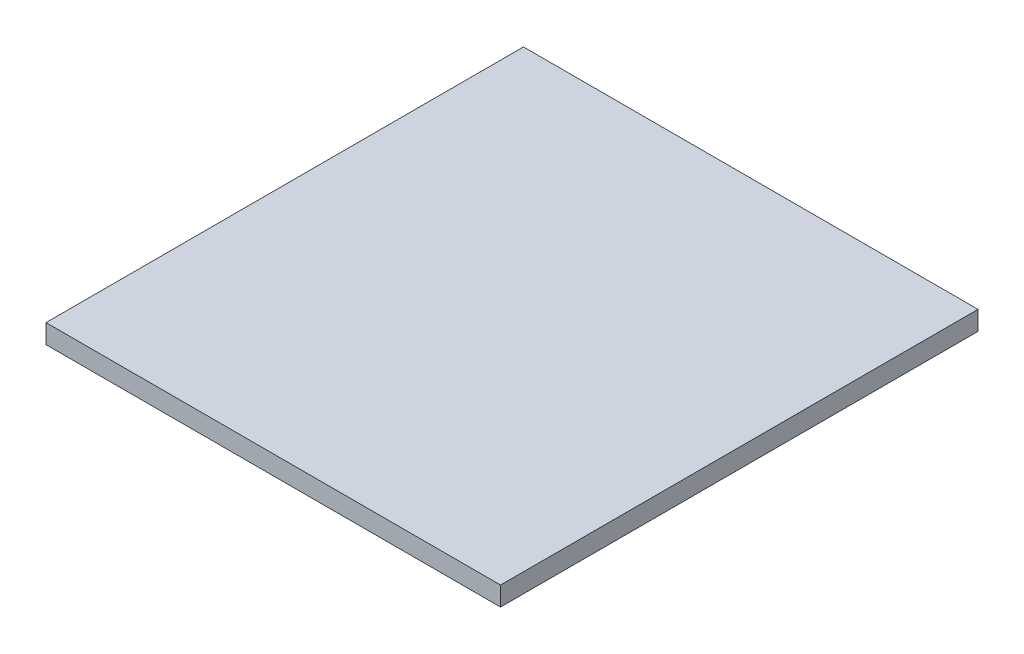
ISO-10303-21;
HEADER;
FILE_DESCRIPTION(('STEP AP214'),'2;1');
FILE_NAME('part.step','',(''),(''),'','','');
FILE_SCHEMA(('AUTOMOTIVE_DESIGN { 1 0 10303 214 1 1 1 1 }'));
ENDSEC;
DATA;
#1=APPLICATION_CONTEXT('core data for automotive mechanical design processes');
#2=APPLICATION_PROTOCOL_DEFINITION('international standard','automotive_design',2000,#1);
#3=PRODUCT_CONTEXT('',#1,'mechanical');
#4=PRODUCT('Part','Part','',(#3));
#5=PRODUCT_RELATED_PRODUCT_CATEGORY('part','',(#4));
#6=PRODUCT_DEFINITION_FORMATION('','',#4);
#7=PRODUCT_DEFINITION_CONTEXT('part definition',#1,'design');
#8=PRODUCT_DEFINITION('design','',#6,#7);
#9=PRODUCT_DEFINITION_SHAPE('','',#8);
#10=(LENGTH_UNIT() NAMED_UNIT(*) SI_UNIT(.MILLI.,.METRE.));
#11=(NAMED_UNIT(*) PLANE_ANGLE_UNIT() SI_UNIT($,.RADIAN.));
#12=(NAMED_UNIT(*) SI_UNIT($,.STERADIAN.) SOLID_ANGLE_UNIT());
#13=UNCERTAINTY_MEASURE_WITH_UNIT(LENGTH_MEASURE(1.E-05),#10,'distance_accuracy_value','');
#14=(GEOMETRIC_REPRESENTATION_CONTEXT(3) GLOBAL_UNCERTAINTY_ASSIGNED_CONTEXT((#13)) GLOBAL_UNIT_ASSIGNED_CONTEXT((#10,
#11,#12)) REPRESENTATION_CONTEXT('',''));
#15=CARTESIAN_POINT('',(0.,0.,0.));
#16=DIRECTION('',(0.,0.,1.));
#17=DIRECTION('',(1.,0.,0.));
#18=AXIS2_PLACEMENT_3D('',#15,#16,#17);
#19=CARTESIAN_POINT('',(0.,10.,0.));
#20=DIRECTION('',(1.,0.,0.));
#21=DIRECTION('',(0.,0.,-1.));
#22=AXIS2_PLACEMENT_3D('',#19,#20,#21);
#23=PLANE('',#22);
#24=DIRECTION('',(0.,0.,1.));
#25=VECTOR('',#24,1.);
#26=CARTESIAN_POINT('',(0.,0.,0.));
#27=LINE('',#26,#25);
#28=CARTESIAN_POINT('',(0.,0.,-250.));
#29=VERTEX_POINT('',#28);
#30=CARTESIAN_POINT('',(0.,0.,0.));
#31=VERTEX_POINT('',#30);
#32=EDGE_CURVE('E107',#29,#31,#27,.T.);
#33=ORIENTED_EDGE('',*,*,#32,.T.);
#34=DIRECTION('',(0.,-1.,0.));
#35=VECTOR('',#34,1.);
#36=CARTESIAN_POINT('',(0.,10.,0.));
#37=LINE('',#36,#35);
#38=CARTESIAN_POINT('',(0.,10.,0.));
#39=VERTEX_POINT('',#38);
#40=EDGE_CURVE('E11',#39,#31,#37,.T.);
#41=ORIENTED_EDGE('',*,*,#40,.F.);
#42=DIRECTION('',(0.,0.,1.));
#43=VECTOR('',#42,1.);
#44=CARTESIAN_POINT('',(0.,10.,0.));
#45=LINE('',#44,#43);
#46=CARTESIAN_POINT('',(0.,10.,-250.));
#47=VERTEX_POINT('',#46);
#48=EDGE_CURVE('E91',#47,#39,#45,.T.);
#49=ORIENTED_EDGE('',*,*,#48,.F.);
#50=DIRECTION('',(0.,-1.,0.));
#51=VECTOR('',#50,1.);
#52=CARTESIAN_POINT('',(0.,10.,-250.));
#53=LINE('',#52,#51);
#54=EDGE_CURVE('E103',#47,#29,#53,.T.);
#55=ORIENTED_EDGE('',*,*,#54,.T.);
#56=EDGE_LOOP('',(#33,#41,#49,#55));
#57=FACE_BOUND('',#56,.T.);
#58=ADVANCED_FACE('F39',(#57),#23,.F.);
#59=CARTESIAN_POINT('',(0.,10.,0.));
#60=DIRECTION('',(0.,0.,-1.));
#61=DIRECTION('',(-1.,0.,0.));
#62=AXIS2_PLACEMENT_3D('',#59,#60,#61);
#63=PLANE('',#62);
#64=DIRECTION('',(1.,0.,0.));
#65=VECTOR('',#64,1.);
#66=CARTESIAN_POINT('',(0.,0.,0.));
#67=LINE('',#66,#65);
#68=CARTESIAN_POINT('',(238.,0.,0.));
#69=VERTEX_POINT('',#68);
#70=EDGE_CURVE('E96',#31,#69,#67,.T.);
#71=ORIENTED_EDGE('',*,*,#70,.T.);
#72=DIRECTION('',(0.,-1.,0.));
#73=VECTOR('',#72,1.);
#74=CARTESIAN_POINT('',(238.,10.,0.));
#75=LINE('',#74,#73);
#76=CARTESIAN_POINT('',(238.,10.,0.));
#77=VERTEX_POINT('',#76);
#78=EDGE_CURVE('E48',#77,#69,#75,.T.);
#79=ORIENTED_EDGE('',*,*,#78,.F.);
#80=DIRECTION('',(1.,0.,0.));
#81=VECTOR('',#80,1.);
#82=CARTESIAN_POINT('',(0.,10.,0.));
#83=LINE('',#82,#81);
#84=EDGE_CURVE('E86',#39,#77,#83,.T.);
#85=ORIENTED_EDGE('',*,*,#84,.F.);
#86=ORIENTED_EDGE('',*,*,#40,.T.);
#87=EDGE_LOOP('',(#71,#79,#85,#86));
#88=FACE_BOUND('',#87,.T.);
#89=ADVANCED_FACE('F95',(#88),#63,.F.);
#90=CARTESIAN_POINT('',(238.,10.,0.));
#91=DIRECTION('',(-1.,0.,0.));
#92=DIRECTION('',(0.,0.,1.));
#93=AXIS2_PLACEMENT_3D('',#90,#91,#92);
#94=PLANE('',#93);
#95=DIRECTION('',(0.,0.,-1.));
#96=VECTOR('',#95,1.);
#97=CARTESIAN_POINT('',(238.,0.,0.));
#98=LINE('',#97,#96);
#99=CARTESIAN_POINT('',(238.,0.,-250.));
#100=VERTEX_POINT('',#99);
#101=EDGE_CURVE('E73',#69,#100,#98,.T.);
#102=ORIENTED_EDGE('',*,*,#101,.T.);
#103=DIRECTION('',(0.,-1.,0.));
#104=VECTOR('',#103,1.);
#105=CARTESIAN_POINT('',(238.,10.,-250.));
#106=LINE('',#105,#104);
#107=CARTESIAN_POINT('',(238.,10.,-250.));
#108=VERTEX_POINT('',#107);
#109=EDGE_CURVE('E98',#108,#100,#106,.T.);
#110=ORIENTED_EDGE('',*,*,#109,.F.);
#111=DIRECTION('',(0.,0.,-1.));
#112=VECTOR('',#111,1.);
#113=CARTESIAN_POINT('',(238.,10.,0.));
#114=LINE('',#113,#112);
#115=EDGE_CURVE('E89',#77,#108,#114,.T.);
#116=ORIENTED_EDGE('',*,*,#115,.F.);
#117=ORIENTED_EDGE('',*,*,#78,.T.);
#118=EDGE_LOOP('',(#102,#110,#116,#117));
#119=FACE_BOUND('',#118,.T.);
#120=ADVANCED_FACE('F99',(#119),#94,.F.);
#121=CARTESIAN_POINT('',(0.,10.,-250.));
#122=DIRECTION('',(0.,0.,1.));
#123=DIRECTION('',(1.,0.,0.));
#124=AXIS2_PLACEMENT_3D('',#121,#122,#123);
#125=PLANE('',#124);
#126=DIRECTION('',(-1.,0.,0.));
#127=VECTOR('',#126,1.);
#128=CARTESIAN_POINT('',(0.,0.,-250.));
#129=LINE('',#128,#127);
#130=EDGE_CURVE('E79',#100,#29,#129,.T.);
#131=ORIENTED_EDGE('',*,*,#130,.T.);
#132=ORIENTED_EDGE('',*,*,#54,.F.);
#133=DIRECTION('',(-1.,0.,0.));
#134=VECTOR('',#133,1.);
#135=CARTESIAN_POINT('',(0.,10.,-250.));
#136=LINE('',#135,#134);
#137=EDGE_CURVE('E56',#108,#47,#136,.T.);
#138=ORIENTED_EDGE('',*,*,#137,.F.);
#139=ORIENTED_EDGE('',*,*,#109,.T.);
#140=EDGE_LOOP('',(#131,#132,#138,#139));
#141=FACE_BOUND('',#140,.T.);
#142=ADVANCED_FACE('F120',(#141),#125,.F.);
#143=CARTESIAN_POINT('',(0.,10.,0.));
#144=DIRECTION('',(0.,-1.,0.));
#145=DIRECTION('',(0.,0.,-1.));
#146=AXIS2_PLACEMENT_3D('',#143,#144,#145);
#147=PLANE('',#146);
#148=ORIENTED_EDGE('',*,*,#48,.T.);
#149=ORIENTED_EDGE('',*,*,#84,.T.);
#150=ORIENTED_EDGE('',*,*,#115,.T.);
#151=ORIENTED_EDGE('',*,*,#137,.T.);
#152=EDGE_LOOP('',(#148,#149,#150,#151));
#153=FACE_BOUND('',#152,.T.);
#154=ADVANCED_FACE('F87',(#153),#147,.F.);
#155=CARTESIAN_POINT('',(0.,0.,0.));
#156=DIRECTION('',(0.,-1.,0.));
#157=DIRECTION('',(0.,0.,-1.));
#158=AXIS2_PLACEMENT_3D('',#155,#156,#157);
#159=PLANE('',#158);
#160=ORIENTED_EDGE('',*,*,#32,.F.);
#161=ORIENTED_EDGE('',*,*,#130,.F.);
#162=ORIENTED_EDGE('',*,*,#101,.F.);
#163=ORIENTED_EDGE('',*,*,#70,.F.);
#164=EDGE_LOOP('',(#160,#161,#162,#163));
#165=FACE_BOUND('',#164,.T.);
#166=ADVANCED_FACE('F123',(#165),#159,.T.);
#167=CLOSED_SHELL('',(#58,#89,#120,#142,#154,#166));
#168=MANIFOLD_SOLID_BREP('B2',#167);
#169=ADVANCED_BREP_SHAPE_REPRESENTATION('',(#18,#168),#14);
#170=SHAPE_DEFINITION_REPRESENTATION(#9,#169);
ENDSEC;
END-ISO-10303-21;
